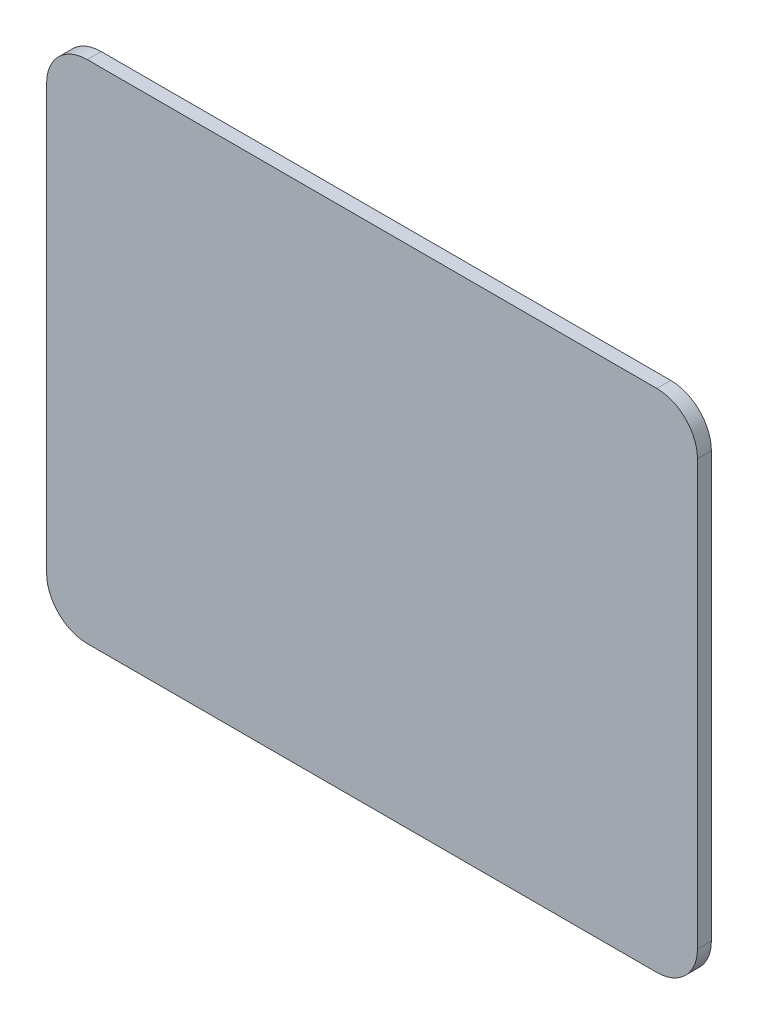
ISO-10303-21;
HEADER;
FILE_DESCRIPTION(('STEP AP214'),'2;1');
FILE_NAME('part.step','',(''),(''),'','','');
FILE_SCHEMA(('AUTOMOTIVE_DESIGN { 1 0 10303 214 1 1 1 1 }'));
ENDSEC;
DATA;
#1=APPLICATION_CONTEXT('core data for automotive mechanical design processes');
#2=APPLICATION_PROTOCOL_DEFINITION('international standard','automotive_design',2000,#1);
#3=PRODUCT_CONTEXT('',#1,'mechanical');
#4=PRODUCT('Part','Part','',(#3));
#5=PRODUCT_RELATED_PRODUCT_CATEGORY('part','',(#4));
#6=PRODUCT_DEFINITION_FORMATION('','',#4);
#7=PRODUCT_DEFINITION_CONTEXT('part definition',#1,'design');
#8=PRODUCT_DEFINITION('design','',#6,#7);
#9=PRODUCT_DEFINITION_SHAPE('','',#8);
#10=(LENGTH_UNIT() NAMED_UNIT(*) SI_UNIT(.MILLI.,.METRE.));
#11=(NAMED_UNIT(*) PLANE_ANGLE_UNIT() SI_UNIT($,.RADIAN.));
#12=(NAMED_UNIT(*) SI_UNIT($,.STERADIAN.) SOLID_ANGLE_UNIT());
#13=UNCERTAINTY_MEASURE_WITH_UNIT(LENGTH_MEASURE(1.E-05),#10,'distance_accuracy_value','');
#14=(GEOMETRIC_REPRESENTATION_CONTEXT(3) GLOBAL_UNCERTAINTY_ASSIGNED_CONTEXT((#13)) GLOBAL_UNIT_ASSIGNED_CONTEXT((#10,
#11,#12)) REPRESENTATION_CONTEXT('',''));
#15=CARTESIAN_POINT('',(0.,0.,0.));
#16=DIRECTION('',(0.,0.,1.));
#17=DIRECTION('',(1.,0.,0.));
#18=AXIS2_PLACEMENT_3D('',#15,#16,#17);
#19=CARTESIAN_POINT('',(-92.8635188465407,25.2599676388741,2.4));
#20=DIRECTION('',(1.,0.,0.));
#21=DIRECTION('',(0.,1.,0.));
#22=AXIS2_PLACEMENT_3D('',#19,#20,#21);
#23=PLANE('',#22);
#24=DIRECTION('',(0.,-1.,0.));
#25=VECTOR('',#24,1.);
#26=CARTESIAN_POINT('',(-92.8635188465407,25.2599676388741,0.));
#27=LINE('',#26,#25);
#28=CARTESIAN_POINT('',(-92.8635188465407,18.2599676388741,0.));
#29=VERTEX_POINT('',#28);
#30=CARTESIAN_POINT('',(-92.8635188465407,-54.9400323611259,0.));
#31=VERTEX_POINT('',#30);
#32=EDGE_CURVE('E128',#29,#31,#27,.T.);
#33=ORIENTED_EDGE('',*,*,#32,.T.);
#34=DIRECTION('',(0.,0.,-1.));
#35=VECTOR('',#34,1.);
#36=CARTESIAN_POINT('',(-92.8635188465407,-54.9400323611259,2.4));
#37=LINE('',#36,#35);
#38=CARTESIAN_POINT('',(-92.8635188465407,-54.9400323611259,2.4));
#39=VERTEX_POINT('',#38);
#40=EDGE_CURVE('E151',#31,#39,#37,.F.);
#41=ORIENTED_EDGE('',*,*,#40,.T.);
#42=DIRECTION('',(0.,-1.,0.));
#43=VECTOR('',#42,1.);
#44=CARTESIAN_POINT('',(-92.8635188465407,25.2599676388741,2.4));
#45=LINE('',#44,#43);
#46=CARTESIAN_POINT('',(-92.8635188465407,18.2599676388741,2.4));
#47=VERTEX_POINT('',#46);
#48=EDGE_CURVE('E126',#47,#39,#45,.T.);
#49=ORIENTED_EDGE('',*,*,#48,.F.);
#50=DIRECTION('',(0.,0.,-1.));
#51=VECTOR('',#50,1.);
#52=CARTESIAN_POINT('',(-92.8635188465407,18.2599676388741,2.4));
#53=LINE('',#52,#51);
#54=EDGE_CURVE('E148',#47,#29,#53,.T.);
#55=ORIENTED_EDGE('',*,*,#54,.T.);
#56=EDGE_LOOP('',(#33,#41,#49,#55));
#57=FACE_BOUND('',#56,.T.);
#58=ADVANCED_FACE('F33',(#57),#23,.F.);
#59=CARTESIAN_POINT('',(-92.8635188465407,-61.9400323611259,2.4));
#60=DIRECTION('',(0.,1.,0.));
#61=DIRECTION('',(0.,0.,1.));
#62=AXIS2_PLACEMENT_3D('',#59,#60,#61);
#63=PLANE('',#62);
#64=DIRECTION('',(1.,0.,0.));
#65=VECTOR('',#64,1.);
#66=CARTESIAN_POINT('',(-92.8635188465407,-61.9400323611259,0.));
#67=LINE('',#66,#65);
#68=CARTESIAN_POINT('',(-85.8635188465407,-61.9400323611259,0.));
#69=VERTEX_POINT('',#68);
#70=CARTESIAN_POINT('',(12.3364811534593,-61.9400323611259,0.));
#71=VERTEX_POINT('',#70);
#72=EDGE_CURVE('E124',#69,#71,#67,.T.);
#73=ORIENTED_EDGE('',*,*,#72,.T.);
#74=DIRECTION('',(0.,0.,-1.));
#75=VECTOR('',#74,1.);
#76=CARTESIAN_POINT('',(12.3364811534593,-61.9400323611259,2.4));
#77=LINE('',#76,#75);
#78=CARTESIAN_POINT('',(12.3364811534593,-61.9400323611259,2.4));
#79=VERTEX_POINT('',#78);
#80=EDGE_CURVE('E103',#71,#79,#77,.F.);
#81=ORIENTED_EDGE('',*,*,#80,.T.);
#82=DIRECTION('',(1.,0.,0.));
#83=VECTOR('',#82,1.);
#84=CARTESIAN_POINT('',(-92.8635188465407,-61.9400323611259,2.4));
#85=LINE('',#84,#83);
#86=CARTESIAN_POINT('',(-85.8635188465407,-61.9400323611259,2.4));
#87=VERTEX_POINT('',#86);
#88=EDGE_CURVE('E167',#87,#79,#85,.T.);
#89=ORIENTED_EDGE('',*,*,#88,.F.);
#90=DIRECTION('',(0.,0.,-1.));
#91=VECTOR('',#90,1.);
#92=CARTESIAN_POINT('',(-85.8635188465407,-61.9400323611259,2.4));
#93=LINE('',#92,#91);
#94=EDGE_CURVE('E108',#87,#69,#93,.T.);
#95=ORIENTED_EDGE('',*,*,#94,.T.);
#96=EDGE_LOOP('',(#73,#81,#89,#95));
#97=FACE_BOUND('',#96,.T.);
#98=ADVANCED_FACE('F184',(#97),#63,.F.);
#99=CARTESIAN_POINT('',(19.3364811534593,25.2599676388741,2.4));
#100=DIRECTION('',(-1.,0.,0.));
#101=DIRECTION('',(0.,-1.,0.));
#102=AXIS2_PLACEMENT_3D('',#99,#100,#101);
#103=PLANE('',#102);
#104=DIRECTION('',(0.,1.,0.));
#105=VECTOR('',#104,1.);
#106=CARTESIAN_POINT('',(19.3364811534593,25.2599676388741,2.4));
#107=LINE('',#106,#105);
#108=CARTESIAN_POINT('',(19.3364811534593,-54.9400323611259,2.4));
#109=VERTEX_POINT('',#108);
#110=CARTESIAN_POINT('',(19.3364811534593,18.2599676388741,2.4));
#111=VERTEX_POINT('',#110);
#112=EDGE_CURVE('E117',#109,#111,#107,.T.);
#113=ORIENTED_EDGE('',*,*,#112,.F.);
#114=DIRECTION('',(0.,0.,-1.));
#115=VECTOR('',#114,1.);
#116=CARTESIAN_POINT('',(19.3364811534593,-54.9400323611259,2.4));
#117=LINE('',#116,#115);
#118=CARTESIAN_POINT('',(19.3364811534593,-54.9400323611259,0.));
#119=VERTEX_POINT('',#118);
#120=EDGE_CURVE('E102',#109,#119,#117,.T.);
#121=ORIENTED_EDGE('',*,*,#120,.T.);
#122=DIRECTION('',(0.,1.,0.));
#123=VECTOR('',#122,1.);
#124=CARTESIAN_POINT('',(19.3364811534593,25.2599676388741,0.));
#125=LINE('',#124,#123);
#126=CARTESIAN_POINT('',(19.3364811534593,18.2599676388741,0.));
#127=VERTEX_POINT('',#126);
#128=EDGE_CURVE('E115',#119,#127,#125,.T.);
#129=ORIENTED_EDGE('',*,*,#128,.T.);
#130=DIRECTION('',(0.,0.,-1.));
#131=VECTOR('',#130,1.);
#132=CARTESIAN_POINT('',(19.3364811534593,18.2599676388741,2.4));
#133=LINE('',#132,#131);
#134=EDGE_CURVE('E119',#127,#111,#133,.F.);
#135=ORIENTED_EDGE('',*,*,#134,.T.);
#136=EDGE_LOOP('',(#113,#121,#129,#135));
#137=FACE_BOUND('',#136,.T.);
#138=ADVANCED_FACE('F114',(#137),#103,.F.);
#139=CARTESIAN_POINT('',(-92.8635188465407,25.2599676388741,2.4));
#140=DIRECTION('',(0.,-1.,0.));
#141=DIRECTION('',(0.,0.,-1.));
#142=AXIS2_PLACEMENT_3D('',#139,#140,#141);
#143=PLANE('',#142);
#144=DIRECTION('',(-1.,0.,0.));
#145=VECTOR('',#144,1.);
#146=CARTESIAN_POINT('',(-92.8635188465407,25.2599676388741,0.));
#147=LINE('',#146,#145);
#148=CARTESIAN_POINT('',(12.3364811534593,25.2599676388741,0.));
#149=VERTEX_POINT('',#148);
#150=CARTESIAN_POINT('',(-85.8635188465407,25.2599676388741,0.));
#151=VERTEX_POINT('',#150);
#152=EDGE_CURVE('E123',#149,#151,#147,.T.);
#153=ORIENTED_EDGE('',*,*,#152,.T.);
#154=DIRECTION('',(0.,0.,-1.));
#155=VECTOR('',#154,1.);
#156=CARTESIAN_POINT('',(-85.8635188465407,25.2599676388741,2.4));
#157=LINE('',#156,#155);
#158=CARTESIAN_POINT('',(-85.8635188465407,25.2599676388741,2.4));
#159=VERTEX_POINT('',#158);
#160=EDGE_CURVE('E11',#151,#159,#157,.F.);
#161=ORIENTED_EDGE('',*,*,#160,.T.);
#162=DIRECTION('',(-1.,0.,0.));
#163=VECTOR('',#162,1.);
#164=CARTESIAN_POINT('',(-92.8635188465407,25.2599676388741,2.4));
#165=LINE('',#164,#163);
#166=CARTESIAN_POINT('',(12.3364811534593,25.2599676388741,2.4));
#167=VERTEX_POINT('',#166);
#168=EDGE_CURVE('E132',#167,#159,#165,.T.);
#169=ORIENTED_EDGE('',*,*,#168,.F.);
#170=DIRECTION('',(0.,0.,-1.));
#171=VECTOR('',#170,1.);
#172=CARTESIAN_POINT('',(12.3364811534593,25.2599676388741,2.4));
#173=LINE('',#172,#171);
#174=EDGE_CURVE('E41',#167,#149,#173,.T.);
#175=ORIENTED_EDGE('',*,*,#174,.T.);
#176=EDGE_LOOP('',(#153,#161,#169,#175));
#177=FACE_BOUND('',#176,.T.);
#178=ADVANCED_FACE('F154',(#177),#143,.F.);
#179=CARTESIAN_POINT('',(0.,0.,2.4));
#180=DIRECTION('',(0.,0.,1.));
#181=DIRECTION('',(1.,0.,0.));
#182=AXIS2_PLACEMENT_3D('',#179,#180,#181);
#183=PLANE('',#182);
#184=ORIENTED_EDGE('',*,*,#88,.T.);
#185=CARTESIAN_POINT('',(12.3364811534593,-54.9400323611259,2.4));
#186=DIRECTION('',(0.,0.,1.));
#187=DIRECTION('',(1.,0.,0.));
#188=AXIS2_PLACEMENT_3D('',#185,#186,#187);
#189=CIRCLE('',#188,7.);
#190=EDGE_CURVE('E146',#79,#109,#189,.T.);
#191=ORIENTED_EDGE('',*,*,#190,.T.);
#192=ORIENTED_EDGE('',*,*,#112,.T.);
#193=CARTESIAN_POINT('',(12.3364811534593,18.2599676388741,2.4));
#194=DIRECTION('',(0.,0.,1.));
#195=DIRECTION('',(1.,0.,0.));
#196=AXIS2_PLACEMENT_3D('',#193,#194,#195);
#197=CIRCLE('',#196,7.);
#198=EDGE_CURVE('E53',#111,#167,#197,.T.);
#199=ORIENTED_EDGE('',*,*,#198,.T.);
#200=ORIENTED_EDGE('',*,*,#168,.T.);
#201=CARTESIAN_POINT('',(-85.8635188465407,18.2599676388741,2.4));
#202=DIRECTION('',(0.,0.,1.));
#203=DIRECTION('',(1.,0.,0.));
#204=AXIS2_PLACEMENT_3D('',#201,#202,#203);
#205=CIRCLE('',#204,7.);
#206=EDGE_CURVE('E142',#159,#47,#205,.T.);
#207=ORIENTED_EDGE('',*,*,#206,.T.);
#208=ORIENTED_EDGE('',*,*,#48,.T.);
#209=CARTESIAN_POINT('',(-85.8635188465407,-54.9400323611259,2.4));
#210=DIRECTION('',(0.,0.,1.));
#211=DIRECTION('',(1.,0.,0.));
#212=AXIS2_PLACEMENT_3D('',#209,#210,#211);
#213=CIRCLE('',#212,7.);
#214=EDGE_CURVE('E144',#39,#87,#213,.T.);
#215=ORIENTED_EDGE('',*,*,#214,.T.);
#216=EDGE_LOOP('',(#184,#191,#192,#199,#200,#207,#208,#215));
#217=FACE_BOUND('',#216,.T.);
#218=ADVANCED_FACE('F173',(#217),#183,.T.);
#219=CARTESIAN_POINT('',(0.,0.,0.));
#220=DIRECTION('',(0.,0.,1.));
#221=DIRECTION('',(1.,0.,0.));
#222=AXIS2_PLACEMENT_3D('',#219,#220,#221);
#223=PLANE('',#222);
#224=ORIENTED_EDGE('',*,*,#128,.F.);
#225=CARTESIAN_POINT('',(12.3364811534593,-54.9400323611259,0.));
#226=DIRECTION('',(0.,0.,1.));
#227=DIRECTION('',(1.,0.,0.));
#228=AXIS2_PLACEMENT_3D('',#225,#226,#227);
#229=CIRCLE('',#228,7.);
#230=EDGE_CURVE('E98',#119,#71,#229,.F.);
#231=ORIENTED_EDGE('',*,*,#230,.T.);
#232=ORIENTED_EDGE('',*,*,#72,.F.);
#233=CARTESIAN_POINT('',(-85.8635188465407,-54.9400323611259,0.));
#234=DIRECTION('',(0.,0.,1.));
#235=DIRECTION('',(1.,0.,0.));
#236=AXIS2_PLACEMENT_3D('',#233,#234,#235);
#237=CIRCLE('',#236,7.);
#238=EDGE_CURVE('E109',#69,#31,#237,.F.);
#239=ORIENTED_EDGE('',*,*,#238,.T.);
#240=ORIENTED_EDGE('',*,*,#32,.F.);
#241=CARTESIAN_POINT('',(-85.8635188465407,18.2599676388741,0.));
#242=DIRECTION('',(0.,0.,1.));
#243=DIRECTION('',(1.,0.,0.));
#244=AXIS2_PLACEMENT_3D('',#241,#242,#243);
#245=CIRCLE('',#244,7.);
#246=EDGE_CURVE('E135',#29,#151,#245,.F.);
#247=ORIENTED_EDGE('',*,*,#246,.T.);
#248=ORIENTED_EDGE('',*,*,#152,.F.);
#249=CARTESIAN_POINT('',(12.3364811534593,18.2599676388741,0.));
#250=DIRECTION('',(0.,0.,1.));
#251=DIRECTION('',(1.,0.,0.));
#252=AXIS2_PLACEMENT_3D('',#249,#250,#251);
#253=CIRCLE('',#252,7.);
#254=EDGE_CURVE('E118',#149,#127,#253,.F.);
#255=ORIENTED_EDGE('',*,*,#254,.T.);
#256=EDGE_LOOP('',(#224,#231,#232,#239,#240,#247,#248,#255));
#257=FACE_BOUND('',#256,.T.);
#258=ADVANCED_FACE('F121',(#257),#223,.F.);
#259=CARTESIAN_POINT('',(12.3364811534593,-54.9400323611259,2.4));
#260=DIRECTION('',(0.,0.,-1.));
#261=DIRECTION('',(-1.,0.,0.));
#262=AXIS2_PLACEMENT_3D('',#259,#260,#261);
#263=CYLINDRICAL_SURFACE('',#262,7.);
#264=ORIENTED_EDGE('',*,*,#190,.F.);
#265=ORIENTED_EDGE('',*,*,#80,.F.);
#266=ORIENTED_EDGE('',*,*,#230,.F.);
#267=ORIENTED_EDGE('',*,*,#120,.F.);
#268=EDGE_LOOP('',(#264,#265,#266,#267));
#269=FACE_BOUND('',#268,.T.);
#270=ADVANCED_FACE('F101',(#269),#263,.T.);
#271=CARTESIAN_POINT('',(-85.8635188465407,-54.9400323611259,2.4));
#272=DIRECTION('',(0.,0.,-1.));
#273=DIRECTION('',(-1.,0.,0.));
#274=AXIS2_PLACEMENT_3D('',#271,#272,#273);
#275=CYLINDRICAL_SURFACE('',#274,7.);
#276=ORIENTED_EDGE('',*,*,#214,.F.);
#277=ORIENTED_EDGE('',*,*,#40,.F.);
#278=ORIENTED_EDGE('',*,*,#238,.F.);
#279=ORIENTED_EDGE('',*,*,#94,.F.);
#280=EDGE_LOOP('',(#276,#277,#278,#279));
#281=FACE_BOUND('',#280,.T.);
#282=ADVANCED_FACE('F195',(#281),#275,.T.);
#283=CARTESIAN_POINT('',(-85.8635188465407,18.2599676388741,2.4));
#284=DIRECTION('',(0.,0.,-1.));
#285=DIRECTION('',(-1.,0.,0.));
#286=AXIS2_PLACEMENT_3D('',#283,#284,#285);
#287=CYLINDRICAL_SURFACE('',#286,7.);
#288=ORIENTED_EDGE('',*,*,#206,.F.);
#289=ORIENTED_EDGE('',*,*,#160,.F.);
#290=ORIENTED_EDGE('',*,*,#246,.F.);
#291=ORIENTED_EDGE('',*,*,#54,.F.);
#292=EDGE_LOOP('',(#288,#289,#290,#291));
#293=FACE_BOUND('',#292,.T.);
#294=ADVANCED_FACE('F161',(#293),#287,.T.);
#295=CARTESIAN_POINT('',(12.3364811534593,18.2599676388741,2.4));
#296=DIRECTION('',(0.,0.,-1.));
#297=DIRECTION('',(-1.,0.,0.));
#298=AXIS2_PLACEMENT_3D('',#295,#296,#297);
#299=CYLINDRICAL_SURFACE('',#298,7.);
#300=ORIENTED_EDGE('',*,*,#198,.F.);
#301=ORIENTED_EDGE('',*,*,#134,.F.);
#302=ORIENTED_EDGE('',*,*,#254,.F.);
#303=ORIENTED_EDGE('',*,*,#174,.F.);
#304=EDGE_LOOP('',(#300,#301,#302,#303));
#305=FACE_BOUND('',#304,.T.);
#306=ADVANCED_FACE('F35',(#305),#299,.T.);
#307=CLOSED_SHELL('',(#58,#98,#138,#178,#218,#258,#270,#282,#294,#306));
#308=MANIFOLD_SOLID_BREP('B2',#307);
#309=ADVANCED_BREP_SHAPE_REPRESENTATION('',(#18,#308),#14);
#310=SHAPE_DEFINITION_REPRESENTATION(#9,#309);
ENDSEC;
END-ISO-10303-21;
